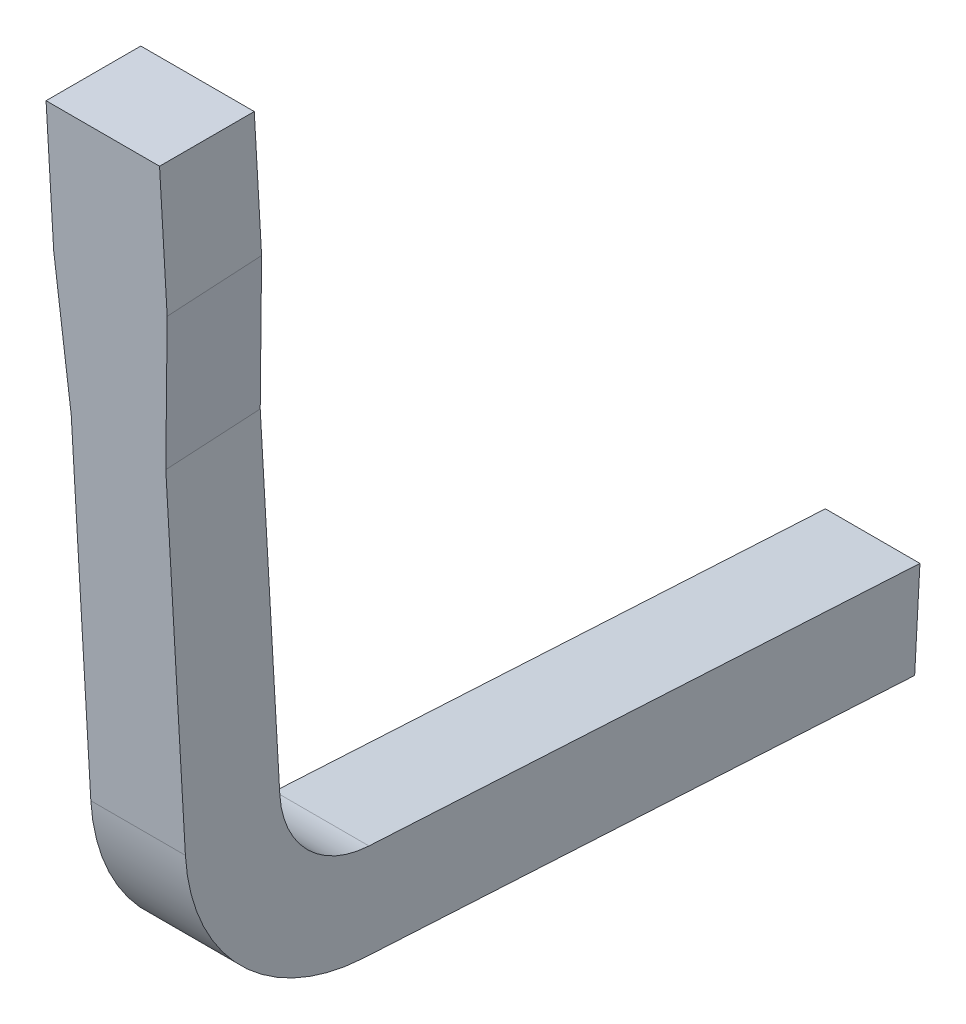
ISO-10303-21;
HEADER;
FILE_DESCRIPTION(('STEP AP214'),'2;1');
FILE_NAME('part.step','',(''),(''),'','','');
FILE_SCHEMA(('AUTOMOTIVE_DESIGN { 1 0 10303 214 1 1 1 1 }'));
ENDSEC;
DATA;
#1=APPLICATION_CONTEXT('core data for automotive mechanical design processes');
#2=APPLICATION_PROTOCOL_DEFINITION('international standard','automotive_design',2000,#1);
#3=PRODUCT_CONTEXT('',#1,'mechanical');
#4=PRODUCT('Part','Part','',(#3));
#5=PRODUCT_RELATED_PRODUCT_CATEGORY('part','',(#4));
#6=PRODUCT_DEFINITION_FORMATION('','',#4);
#7=PRODUCT_DEFINITION_CONTEXT('part definition',#1,'design');
#8=PRODUCT_DEFINITION('design','',#6,#7);
#9=PRODUCT_DEFINITION_SHAPE('','',#8);
#10=(LENGTH_UNIT() NAMED_UNIT(*) SI_UNIT(.MILLI.,.METRE.));
#11=(NAMED_UNIT(*) PLANE_ANGLE_UNIT() SI_UNIT($,.RADIAN.));
#12=(NAMED_UNIT(*) SI_UNIT($,.STERADIAN.) SOLID_ANGLE_UNIT());
#13=UNCERTAINTY_MEASURE_WITH_UNIT(LENGTH_MEASURE(1.E-05),#10,'distance_accuracy_value','');
#14=(GEOMETRIC_REPRESENTATION_CONTEXT(3) GLOBAL_UNCERTAINTY_ASSIGNED_CONTEXT((#13)) GLOBAL_UNIT_ASSIGNED_CONTEXT((#10,
#11,#12)) REPRESENTATION_CONTEXT('',''));
#15=CARTESIAN_POINT('',(0.,0.,0.));
#16=DIRECTION('',(0.,0.,1.));
#17=DIRECTION('',(1.,0.,0.));
#18=AXIS2_PLACEMENT_3D('',#15,#16,#17);
#19=CARTESIAN_POINT('',(3.88,-1.879082198882,-10.32387202233));
#20=DIRECTION('',(1.,0.,0.));
#21=DIRECTION('',(0.,0.,-1.));
#22=AXIS2_PLACEMENT_3D('',#19,#20,#21);
#23=PLANE('',#22);
#24=DIRECTION('',(1.77809156290928E-13,-0.0569406083160465,0.998377567418559));
#25=VECTOR('',#24,1.);
#26=CARTESIAN_POINT('',(3.88000000000003,-2.014836222708,-10.43177700759));
#27=LINE('',#26,#25);
#28=CARTESIAN_POINT('',(3.88000000000001,-2.01483622270796,-10.4317770075908));
#29=VERTEX_POINT('',#28);
#30=CARTESIAN_POINT('',(3.88000000000002,-2.02622434437118,-10.2321014941066));
#31=VERTEX_POINT('',#30);
#32=EDGE_CURVE('E183',#29,#31,#27,.T.);
#33=ORIENTED_EDGE('',*,*,#32,.T.);
#34=DIRECTION('',(0.,-0.998377567418999,-0.0569406083083299));
#35=VECTOR('',#34,1.);
#36=CARTESIAN_POINT('',(3.88,-2.398052209196,-10.25330800505));
#37=LINE('',#36,#35);
#38=CARTESIAN_POINT('',(3.88,-1.74332817505504,-10.2159670370689));
#39=VERTEX_POINT('',#38);
#40=EDGE_CURVE('E180',#39,#31,#37,.T.);
#41=ORIENTED_EDGE('',*,*,#40,.F.);
#42=DIRECTION('',(0.,0.,1.));
#43=VECTOR('',#42,1.);
#44=CARTESIAN_POINT('',(3.88,-1.743328175055,-10.31612954398));
#45=LINE('',#44,#43);
#46=CARTESIAN_POINT('',(3.88,-1.74332817505473,-10.4162920508947));
#47=VERTEX_POINT('',#46);
#48=EDGE_CURVE('E175',#47,#39,#45,.T.);
#49=ORIENTED_EDGE('',*,*,#48,.F.);
#50=DIRECTION('',(0.,-0.998377567418624,-0.0569406083148914));
#51=VECTOR('',#50,1.);
#52=CARTESIAN_POINT('',(3.88,-2.392358148368,-10.45330826871));
#53=LINE('',#52,#51);
#54=EDGE_CURVE('E205',#47,#29,#53,.T.);
#55=ORIENTED_EDGE('',*,*,#54,.T.);
#56=EDGE_LOOP('',(#33,#41,#49,#55));
#57=FACE_BOUND('',#56,.T.);
#58=ADVANCED_FACE('F17',(#57),#23,.F.);
#59=CARTESIAN_POINT('',(3.89,-2.170286918652,-10.34048034209));
#60=DIRECTION('',(0.997785157856611,0.0664110879137907,0.00378763292362404));
#61=DIRECTION('',(-0.0664115642910679,0.99779231512796,0.));
#62=AXIS2_PLACEMENT_3D('',#59,#60,#61);
#63=PLANE('',#62);
#64=DIRECTION('',(0.0665190105237393,-0.996166318707665,-0.0568144938493813));
#65=VECTOR('',#64,1.);
#66=CARTESIAN_POINT('',(3.88,-2.02622434437119,-10.2321014941066));
#67=LINE('',#66,#65);
#68=CARTESIAN_POINT('',(3.9,-2.32573761459706,-10.2491836765991));
#69=VERTEX_POINT('',#68);
#70=EDGE_CURVE('E161',#31,#69,#67,.T.);
#71=ORIENTED_EDGE('',*,*,#70,.F.);
#72=ORIENTED_EDGE('',*,*,#32,.F.);
#73=DIRECTION('',(0.0665190105237394,-0.996166318707292,-0.0568144938559241));
#74=VECTOR('',#73,1.);
#75=CARTESIAN_POINT('',(3.88,-2.01483622270793,-10.4317770075911));
#76=LINE('',#75,#74);
#77=CARTESIAN_POINT('',(3.9,-2.31434949293379,-10.4488591900838));
#78=VERTEX_POINT('',#77);
#79=EDGE_CURVE('E115',#29,#78,#76,.T.);
#80=ORIENTED_EDGE('',*,*,#79,.T.);
#81=DIRECTION('',(0.,-0.0569406083160594,0.998377567418558));
#82=VECTOR('',#81,1.);
#83=CARTESIAN_POINT('',(3.9,-2.314349492934,-10.44885919008));
#84=LINE('',#83,#82);
#85=EDGE_CURVE('E110',#78,#69,#84,.T.);
#86=ORIENTED_EDGE('',*,*,#85,.T.);
#87=EDGE_LOOP('',(#71,#72,#80,#86));
#88=FACE_BOUND('',#87,.T.);
#89=ADVANCED_FACE('F288',(#88),#63,.F.);
#90=CARTESIAN_POINT('',(4.12,-1.879082198882,-10.32387202233));
#91=DIRECTION('',(1.,0.,0.));
#92=DIRECTION('',(0.,0.,-1.));
#93=AXIS2_PLACEMENT_3D('',#90,#91,#92);
#94=PLANE('',#93);
#95=DIRECTION('',(0.,-0.998377567418624,-0.0569406083148914));
#96=VECTOR('',#95,1.);
#97=CARTESIAN_POINT('',(4.12,-2.392358148368,-10.45330826871));
#98=LINE('',#97,#96);
#99=CARTESIAN_POINT('',(4.12000000000002,-2.01483622270898,-10.4317770075904));
#100=VERTEX_POINT('',#99);
#101=CARTESIAN_POINT('',(4.12,-1.74332817505473,-10.4162920508947));
#102=VERTEX_POINT('',#101);
#103=EDGE_CURVE('E128',#100,#102,#98,.F.);
#104=ORIENTED_EDGE('',*,*,#103,.T.);
#105=DIRECTION('',(0.,0.,1.));
#106=VECTOR('',#105,1.);
#107=CARTESIAN_POINT('',(4.12,-1.743328175055,-10.31612954398));
#108=LINE('',#107,#106);
#109=CARTESIAN_POINT('',(4.12,-1.74332817505504,-10.2159670370692));
#110=VERTEX_POINT('',#109);
#111=EDGE_CURVE('E185',#110,#102,#108,.F.);
#112=ORIENTED_EDGE('',*,*,#111,.F.);
#113=DIRECTION('',(0.,-0.998377567418999,-0.0569406083083299));
#114=VECTOR('',#113,1.);
#115=CARTESIAN_POINT('',(4.12,-2.398052209196,-10.25330800505));
#116=LINE('',#115,#114);
#117=CARTESIAN_POINT('',(4.12000000000001,-2.02622434437119,-10.2321014941066));
#118=VERTEX_POINT('',#117);
#119=EDGE_CURVE('E168',#118,#110,#116,.F.);
#120=ORIENTED_EDGE('',*,*,#119,.F.);
#121=DIRECTION('',(0.,-0.0569406083110731,0.998377567418842));
#122=VECTOR('',#121,1.);
#123=CARTESIAN_POINT('',(4.12000000000003,-2.014836222709,-10.43177700759));
#124=LINE('',#123,#122);
#125=EDGE_CURVE('E131',#100,#118,#124,.T.);
#126=ORIENTED_EDGE('',*,*,#125,.F.);
#127=EDGE_LOOP('',(#104,#112,#120,#126));
#128=FACE_BOUND('',#127,.T.);
#129=ADVANCED_FACE('F251',(#128),#94,.T.);
#130=CARTESIAN_POINT('',(4.,-1.743328175055,-10.31612954398));
#131=DIRECTION('',(0.,1.,0.));
#132=DIRECTION('',(0.,0.,1.));
#133=AXIS2_PLACEMENT_3D('',#130,#131,#132);
#134=PLANE('',#133);
#135=DIRECTION('',(1.,0.,0.));
#136=VECTOR('',#135,1.);
#137=CARTESIAN_POINT('',(4.,-1.74332817505459,-10.4162920508971));
#138=LINE('',#137,#136);
#139=EDGE_CURVE('E138',#102,#47,#138,.F.);
#140=ORIENTED_EDGE('',*,*,#139,.T.);
#141=ORIENTED_EDGE('',*,*,#48,.T.);
#142=DIRECTION('',(1.,0.,0.));
#143=VECTOR('',#142,1.);
#144=CARTESIAN_POINT('',(4.,-1.74332817505506,-10.2159670370689));
#145=LINE('',#144,#143);
#146=EDGE_CURVE('E171',#110,#39,#145,.F.);
#147=ORIENTED_EDGE('',*,*,#146,.F.);
#148=ORIENTED_EDGE('',*,*,#111,.T.);
#149=EDGE_LOOP('',(#140,#141,#147,#148));
#150=FACE_BOUND('',#149,.T.);
#151=ADVANCED_FACE('F291',(#150),#134,.T.);
#152=CARTESIAN_POINT('',(3.9,-2.898875732105,-11.04167004462));
#153=DIRECTION('',(1.,0.,0.));
#154=DIRECTION('',(0.,0.,-1.));
#155=AXIS2_PLACEMENT_3D('',#152,#153,#154);
#156=PLANE('',#155);
#157=CARTESIAN_POINT('',(3.9,-3.03,-10.69));
#158=DIRECTION('',(-1.,0.,0.));
#159=DIRECTION('',(0.,0.,1.));
#160=AXIS2_PLACEMENT_3D('',#157,#158,#159);
#161=CIRCLE('',#160,0.4);
#162=CARTESIAN_POINT('',(3.9,-3.05277624332116,-10.2906489730313));
#163=VERTEX_POINT('',#162);
#164=CARTESIAN_POINT('',(3.9,-3.42937693582933,-10.6676826720305));
#165=VERTEX_POINT('',#164);
#166=EDGE_CURVE('E155',#163,#165,#161,.F.);
#167=ORIENTED_EDGE('',*,*,#166,.F.);
#168=DIRECTION('',(0.,-0.998377567418999,-0.0569406083083299));
#169=VECTOR('',#168,1.);
#170=CARTESIAN_POINT('',(3.9,-2.398052209196,-10.25330800505));
#171=LINE('',#170,#169);
#172=EDGE_CURVE('E158',#69,#163,#171,.T.);
#173=ORIENTED_EDGE('',*,*,#172,.F.);
#174=ORIENTED_EDGE('',*,*,#85,.F.);
#175=DIRECTION('',(0.,-0.998377567418624,-0.0569406083148914));
#176=VECTOR('',#175,1.);
#177=CARTESIAN_POINT('',(3.9,-2.392358148368,-10.45330826871));
#178=LINE('',#177,#176);
#179=CARTESIAN_POINT('',(3.9,-3.0413881216286,-10.4903244865199));
#180=VERTEX_POINT('',#179);
#181=EDGE_CURVE('E104',#78,#180,#178,.T.);
#182=ORIENTED_EDGE('',*,*,#181,.T.);
#183=CARTESIAN_POINT('',(3.9,-3.03,-10.69));
#184=DIRECTION('',(-1.,0.,0.));
#185=DIRECTION('',(0.,0.,1.));
#186=AXIS2_PLACEMENT_3D('',#183,#184,#185);
#187=CIRCLE('',#186,0.2);
#188=CARTESIAN_POINT('',(3.9,-3.22968846791482,-10.6788413360177));
#189=VERTEX_POINT('',#188);
#190=EDGE_CURVE('E20',#180,#189,#187,.F.);
#191=ORIENTED_EDGE('',*,*,#190,.T.);
#192=DIRECTION('',(0.,0.0557933199228295,0.998442339572991));
#193=VECTOR('',#192,1.);
#194=CARTESIAN_POINT('',(3.9,-3.262244863925,-11.26145022621));
#195=LINE('',#194,#193);
#196=CARTESIAN_POINT('',(3.9,-3.29480125993501,-11.8440591164004));
#197=VERTEX_POINT('',#196);
#198=EDGE_CURVE('E123',#197,#189,#195,.T.);
#199=ORIENTED_EDGE('',*,*,#198,.F.);
#200=DIRECTION('',(0.,-0.998442339574031,0.0557933199042218));
#201=VECTOR('',#200,1.);
#202=CARTESIAN_POINT('',(3.9,-3.394645493892,-11.83847978441));
#203=LINE('',#202,#201);
#204=CARTESIAN_POINT('',(3.9,-3.49448972784906,-11.8329004524196));
#205=VERTEX_POINT('',#204);
#206=EDGE_CURVE('E148',#197,#205,#203,.T.);
#207=ORIENTED_EDGE('',*,*,#206,.T.);
#208=DIRECTION('',(0.,0.055793319922371,0.998442339573017));
#209=VECTOR('',#208,1.);
#210=CARTESIAN_POINT('',(3.9,-3.461933331839,-11.25029156222));
#211=LINE('',#210,#209);
#212=EDGE_CURVE('E153',#205,#165,#211,.T.);
#213=ORIENTED_EDGE('',*,*,#212,.T.);
#214=EDGE_LOOP('',(#167,#173,#174,#182,#191,#199,#207,#213));
#215=FACE_BOUND('',#214,.T.);
#216=ADVANCED_FACE('F107',(#215),#156,.F.);
#217=CARTESIAN_POINT('',(4.,-3.262244863925,-11.26145022621));
#218=DIRECTION('',(0.,0.998442339572991,-0.0557933199228295));
#219=DIRECTION('',(0.,0.0557933199228295,0.998442339572991));
#220=AXIS2_PLACEMENT_3D('',#217,#218,#219);
#221=PLANE('',#220);
#222=DIRECTION('',(0.,0.055793319922887,0.998442339572988));
#223=VECTOR('',#222,1.);
#224=CARTESIAN_POINT('',(4.1,-3.294801259935,-11.8440591164));
#225=LINE('',#224,#223);
#226=CARTESIAN_POINT('',(4.1,-3.29480125993501,-11.8440591164001));
#227=VERTEX_POINT('',#226);
#228=CARTESIAN_POINT('',(4.1,-3.2296884679148,-10.6788413360177));
#229=VERTEX_POINT('',#228);
#230=EDGE_CURVE('E142',#227,#229,#225,.T.);
#231=ORIENTED_EDGE('',*,*,#230,.F.);
#232=DIRECTION('',(1.,0.,0.));
#233=VECTOR('',#232,1.);
#234=CARTESIAN_POINT('',(4.,-3.29480125993502,-11.8440591164004));
#235=LINE('',#234,#233);
#236=EDGE_CURVE('E139',#227,#197,#235,.F.);
#237=ORIENTED_EDGE('',*,*,#236,.T.);
#238=ORIENTED_EDGE('',*,*,#198,.T.);
#239=DIRECTION('',(-1.,0.,0.));
#240=VECTOR('',#239,1.);
#241=CARTESIAN_POINT('',(4.104,-3.22968846791485,-10.67884133602));
#242=LINE('',#241,#240);
#243=EDGE_CURVE('E122',#189,#229,#242,.F.);
#244=ORIENTED_EDGE('',*,*,#243,.T.);
#245=EDGE_LOOP('',(#231,#237,#238,#244));
#246=FACE_BOUND('',#245,.T.);
#247=ADVANCED_FACE('F284',(#246),#221,.T.);
#248=CARTESIAN_POINT('',(4.104,-3.03,-10.69));
#249=DIRECTION('',(-1.,0.,0.));
#250=DIRECTION('',(0.,0.,1.));
#251=AXIS2_PLACEMENT_3D('',#248,#249,#250);
#252=CYLINDRICAL_SURFACE('',#251,0.2);
#253=ORIENTED_EDGE('',*,*,#190,.F.);
#254=DIRECTION('',(1.,0.,0.));
#255=VECTOR('',#254,1.);
#256=CARTESIAN_POINT('',(4.,-3.04138812159455,-10.4903244865179));
#257=LINE('',#256,#255);
#258=CARTESIAN_POINT('',(4.1,-3.04138812162905,-10.4903244865184));
#259=VERTEX_POINT('',#258);
#260=EDGE_CURVE('E114',#180,#259,#257,.T.);
#261=ORIENTED_EDGE('',*,*,#260,.T.);
#262=CARTESIAN_POINT('',(4.1,-3.03,-10.69));
#263=DIRECTION('',(-1.,0.,0.));
#264=DIRECTION('',(0.,0.,1.));
#265=AXIS2_PLACEMENT_3D('',#262,#263,#264);
#266=CIRCLE('',#265,0.2);
#267=EDGE_CURVE('E223',#229,#259,#266,.T.);
#268=ORIENTED_EDGE('',*,*,#267,.F.);
#269=ORIENTED_EDGE('',*,*,#243,.F.);
#270=EDGE_LOOP('',(#253,#261,#268,#269));
#271=FACE_BOUND('',#270,.T.);
#272=ADVANCED_FACE('F119',(#271),#252,.F.);
#273=CARTESIAN_POINT('',(4.,-2.392358148368,-10.45330826871));
#274=DIRECTION('',(0.,-0.0569406083148914,0.998377567418624));
#275=DIRECTION('',(0.,-0.998377567418624,-0.0569406083148914));
#276=AXIS2_PLACEMENT_3D('',#273,#274,#275);
#277=PLANE('',#276);
#278=DIRECTION('',(0.0665190105240578,0.996166318708109,0.0568144938412267));
#279=VECTOR('',#278,1.);
#280=CARTESIAN_POINT('',(4.1,-2.314349492934,-10.44885919008));
#281=LINE('',#280,#279);
#282=CARTESIAN_POINT('',(4.1,-2.314349492934,-10.44885919008));
#283=VERTEX_POINT('',#282);
#284=EDGE_CURVE('E165',#283,#100,#281,.T.);
#285=ORIENTED_EDGE('',*,*,#284,.F.);
#286=DIRECTION('',(0.,0.998377567418421,0.0569406083184697));
#287=VECTOR('',#286,1.);
#288=CARTESIAN_POINT('',(4.1,-3.041388121684,-10.49032448652));
#289=LINE('',#288,#287);
#290=EDGE_CURVE('E126',#259,#283,#289,.T.);
#291=ORIENTED_EDGE('',*,*,#290,.F.);
#292=ORIENTED_EDGE('',*,*,#260,.F.);
#293=ORIENTED_EDGE('',*,*,#181,.F.);
#294=ORIENTED_EDGE('',*,*,#79,.F.);
#295=ORIENTED_EDGE('',*,*,#54,.F.);
#296=ORIENTED_EDGE('',*,*,#139,.F.);
#297=ORIENTED_EDGE('',*,*,#103,.F.);
#298=EDGE_LOOP('',(#285,#291,#292,#293,#294,#295,#296,#297));
#299=FACE_BOUND('',#298,.T.);
#300=ADVANCED_FACE('F124',(#299),#277,.F.);
#301=CARTESIAN_POINT('',(4.11,-2.170286918653,-10.34048034209));
#302=DIRECTION('',(0.99778515785659,-0.0664110879141193,-0.00378763292348296));
#303=DIRECTION('',(0.0664115642913965,0.997792315127938,0.));
#304=AXIS2_PLACEMENT_3D('',#301,#302,#303);
#305=PLANE('',#304);
#306=DIRECTION('',(0.,-0.0569406083160594,0.998377567418558));
#307=VECTOR('',#306,1.);
#308=CARTESIAN_POINT('',(4.1,-2.314349492934,-10.44885919008));
#309=LINE('',#308,#307);
#310=CARTESIAN_POINT('',(4.1,-2.32573761459702,-10.2491836765997));
#311=VERTEX_POINT('',#310);
#312=EDGE_CURVE('E238',#283,#311,#309,.T.);
#313=ORIENTED_EDGE('',*,*,#312,.F.);
#314=ORIENTED_EDGE('',*,*,#284,.T.);
#315=ORIENTED_EDGE('',*,*,#125,.T.);
#316=DIRECTION('',(0.0665190105237422,0.996166318707665,0.0568144938493813));
#317=VECTOR('',#316,1.);
#318=CARTESIAN_POINT('',(4.1,-2.32573761459705,-10.2491836765991));
#319=LINE('',#318,#317);
#320=EDGE_CURVE('E160',#311,#118,#319,.T.);
#321=ORIENTED_EDGE('',*,*,#320,.F.);
#322=EDGE_LOOP('',(#313,#314,#315,#321));
#323=FACE_BOUND('',#322,.T.);
#324=ADVANCED_FACE('F245',(#323),#305,.T.);
#325=CARTESIAN_POINT('',(4.,-2.398052209196,-10.25330800505));
#326=DIRECTION('',(0.,-0.0569406083083299,0.998377567418999));
#327=DIRECTION('',(0.,-0.998377567418999,-0.0569406083083299));
#328=AXIS2_PLACEMENT_3D('',#325,#326,#327);
#329=PLANE('',#328);
#330=ORIENTED_EDGE('',*,*,#119,.T.);
#331=ORIENTED_EDGE('',*,*,#146,.T.);
#332=ORIENTED_EDGE('',*,*,#40,.T.);
#333=ORIENTED_EDGE('',*,*,#70,.T.);
#334=ORIENTED_EDGE('',*,*,#172,.T.);
#335=DIRECTION('',(-1.,0.,0.));
#336=VECTOR('',#335,1.);
#337=CARTESIAN_POINT('',(4.104,-3.05277624331888,-10.2906489730321));
#338=LINE('',#337,#336);
#339=CARTESIAN_POINT('',(4.1,-3.05277624332089,-10.2906489730312));
#340=VERTEX_POINT('',#339);
#341=EDGE_CURVE('E198',#340,#163,#338,.T.);
#342=ORIENTED_EDGE('',*,*,#341,.F.);
#343=DIRECTION('',(0.,-0.998377567419076,-0.0569406083069694));
#344=VECTOR('',#343,1.);
#345=CARTESIAN_POINT('',(4.1,-2.325737614597,-10.2491836766));
#346=LINE('',#345,#344);
#347=EDGE_CURVE('E222',#311,#340,#346,.T.);
#348=ORIENTED_EDGE('',*,*,#347,.F.);
#349=ORIENTED_EDGE('',*,*,#320,.T.);
#350=EDGE_LOOP('',(#330,#331,#332,#333,#334,#342,#348,#349));
#351=FACE_BOUND('',#350,.T.);
#352=ADVANCED_FACE('F255',(#351),#329,.T.);
#353=CARTESIAN_POINT('',(4.104,-3.03,-10.69));
#354=DIRECTION('',(-1.,0.,0.));
#355=DIRECTION('',(0.,0.,1.));
#356=AXIS2_PLACEMENT_3D('',#353,#354,#355);
#357=CYLINDRICAL_SURFACE('',#356,0.4);
#358=DIRECTION('',(1.,0.,0.));
#359=VECTOR('',#358,1.);
#360=CARTESIAN_POINT('',(4.,-3.4293769358293,-10.66768267203));
#361=LINE('',#360,#359);
#362=CARTESIAN_POINT('',(4.1,-3.42937693582946,-10.6676826720306));
#363=VERTEX_POINT('',#362);
#364=EDGE_CURVE('E150',#165,#363,#361,.T.);
#365=ORIENTED_EDGE('',*,*,#364,.T.);
#366=CARTESIAN_POINT('',(4.1,-3.03,-10.69));
#367=DIRECTION('',(-1.,0.,0.));
#368=DIRECTION('',(0.,0.,1.));
#369=AXIS2_PLACEMENT_3D('',#366,#367,#368);
#370=CIRCLE('',#369,0.4);
#371=EDGE_CURVE('E219',#340,#363,#370,.F.);
#372=ORIENTED_EDGE('',*,*,#371,.F.);
#373=ORIENTED_EDGE('',*,*,#341,.T.);
#374=ORIENTED_EDGE('',*,*,#166,.T.);
#375=EDGE_LOOP('',(#365,#372,#373,#374));
#376=FACE_BOUND('',#375,.T.);
#377=ADVANCED_FACE('F273',(#376),#357,.T.);
#378=CARTESIAN_POINT('',(4.,-3.461933331839,-11.25029156222));
#379=DIRECTION('',(0.,0.998442339573017,-0.055793319922371));
#380=DIRECTION('',(0.,0.055793319922371,0.998442339573017));
#381=AXIS2_PLACEMENT_3D('',#378,#379,#380);
#382=PLANE('',#381);
#383=ORIENTED_EDGE('',*,*,#364,.F.);
#384=ORIENTED_EDGE('',*,*,#212,.F.);
#385=DIRECTION('',(1.,0.,0.));
#386=VECTOR('',#385,1.);
#387=CARTESIAN_POINT('',(4.,-3.49448972784898,-11.8329004524196));
#388=LINE('',#387,#386);
#389=CARTESIAN_POINT('',(4.1,-3.49448972784899,-11.8329004524199));
#390=VERTEX_POINT('',#389);
#391=EDGE_CURVE('E35',#205,#390,#388,.T.);
#392=ORIENTED_EDGE('',*,*,#391,.T.);
#393=DIRECTION('',(0.,-0.0557933199219327,-0.998442339573042));
#394=VECTOR('',#393,1.);
#395=CARTESIAN_POINT('',(4.1,-3.429376935829,-10.66768267202));
#396=LINE('',#395,#394);
#397=EDGE_CURVE('E26',#363,#390,#396,.T.);
#398=ORIENTED_EDGE('',*,*,#397,.F.);
#399=EDGE_LOOP('',(#383,#384,#392,#398));
#400=FACE_BOUND('',#399,.T.);
#401=ADVANCED_FACE('F274',(#400),#382,.F.);
#402=CARTESIAN_POINT('',(4.,-3.394645493892,-11.83847978441));
#403=DIRECTION('',(0.,0.0557933199042218,0.998442339574031));
#404=DIRECTION('',(0.,-0.998442339574031,0.0557933199042218));
#405=AXIS2_PLACEMENT_3D('',#402,#403,#404);
#406=PLANE('',#405);
#407=DIRECTION('',(0.,0.998442339574254,-0.0557933199002383));
#408=VECTOR('',#407,1.);
#409=CARTESIAN_POINT('',(4.1,-3.494489727849,-11.83290045242));
#410=LINE('',#409,#408);
#411=EDGE_CURVE('E11',#390,#227,#410,.T.);
#412=ORIENTED_EDGE('',*,*,#411,.F.);
#413=ORIENTED_EDGE('',*,*,#391,.F.);
#414=ORIENTED_EDGE('',*,*,#206,.F.);
#415=ORIENTED_EDGE('',*,*,#236,.F.);
#416=EDGE_LOOP('',(#412,#413,#414,#415));
#417=FACE_BOUND('',#416,.T.);
#418=ADVANCED_FACE('F281',(#417),#406,.F.);
#419=CARTESIAN_POINT('',(4.1,-2.909472777839,-11.05227927458));
#420=DIRECTION('',(1.,0.,0.));
#421=DIRECTION('',(0.,0.,-1.));
#422=AXIS2_PLACEMENT_3D('',#419,#420,#421);
#423=PLANE('',#422);
#424=ORIENTED_EDGE('',*,*,#397,.T.);
#425=ORIENTED_EDGE('',*,*,#411,.T.);
#426=ORIENTED_EDGE('',*,*,#230,.T.);
#427=ORIENTED_EDGE('',*,*,#267,.T.);
#428=ORIENTED_EDGE('',*,*,#290,.T.);
#429=ORIENTED_EDGE('',*,*,#312,.T.);
#430=ORIENTED_EDGE('',*,*,#347,.T.);
#431=ORIENTED_EDGE('',*,*,#371,.T.);
#432=EDGE_LOOP('',(#424,#425,#426,#427,#428,#429,#430,#431));
#433=FACE_BOUND('',#432,.T.);
#434=ADVANCED_FACE('F260',(#433),#423,.T.);
#435=CLOSED_SHELL('',(#58,#89,#129,#151,#216,#247,#272,#300,#324,#352,#377,#401,#418,#434));
#436=MANIFOLD_SOLID_BREP('B1',#435);
#437=ADVANCED_BREP_SHAPE_REPRESENTATION('',(#18,#436),#14);
#438=SHAPE_DEFINITION_REPRESENTATION(#9,#437);
ENDSEC;
END-ISO-10303-21;
